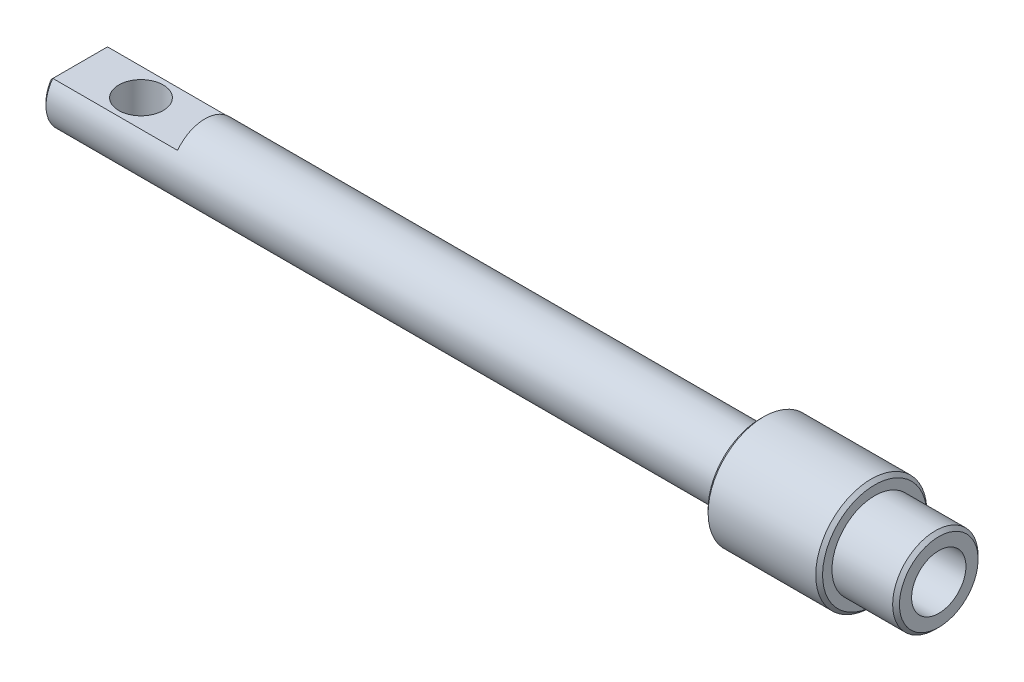
ISO-10303-21;
HEADER;
FILE_DESCRIPTION(('STEP AP214'),'2;1');
FILE_NAME('part.step','',(''),(''),'','','');
FILE_SCHEMA(('AUTOMOTIVE_DESIGN { 1 0 10303 214 1 1 1 1 }'));
ENDSEC;
DATA;
#1=APPLICATION_CONTEXT('core data for automotive mechanical design processes');
#2=APPLICATION_PROTOCOL_DEFINITION('international standard','automotive_design',2000,#1);
#3=PRODUCT_CONTEXT('',#1,'mechanical');
#4=PRODUCT('Part','Part','',(#3));
#5=PRODUCT_RELATED_PRODUCT_CATEGORY('part','',(#4));
#6=PRODUCT_DEFINITION_FORMATION('','',#4);
#7=PRODUCT_DEFINITION_CONTEXT('part definition',#1,'design');
#8=PRODUCT_DEFINITION('design','',#6,#7);
#9=PRODUCT_DEFINITION_SHAPE('','',#8);
#10=(LENGTH_UNIT() NAMED_UNIT(*) SI_UNIT(.MILLI.,.METRE.));
#11=(NAMED_UNIT(*) PLANE_ANGLE_UNIT() SI_UNIT($,.RADIAN.));
#12=(NAMED_UNIT(*) SI_UNIT($,.STERADIAN.) SOLID_ANGLE_UNIT());
#13=UNCERTAINTY_MEASURE_WITH_UNIT(LENGTH_MEASURE(1.E-05),#10,'distance_accuracy_value','');
#14=(GEOMETRIC_REPRESENTATION_CONTEXT(3) GLOBAL_UNCERTAINTY_ASSIGNED_CONTEXT((#13)) GLOBAL_UNIT_ASSIGNED_CONTEXT((#10,
#11,#12)) REPRESENTATION_CONTEXT('',''));
#15=CARTESIAN_POINT('',(0.,0.,0.));
#16=DIRECTION('',(0.,0.,1.));
#17=DIRECTION('',(1.,0.,0.));
#18=AXIS2_PLACEMENT_3D('',#15,#16,#17);
#19=CARTESIAN_POINT('',(54.5465000000149,0.,0.));
#20=DIRECTION('',(1.,0.,0.));
#21=DIRECTION('',(0.,1.,0.));
#22=AXIS2_PLACEMENT_3D('',#19,#20,#21);
#23=CONICAL_SURFACE('',#22,2.01929999997219,1.02974425867198);
#24=CARTESIAN_POINT('',(53.3331821520164,0.,0.));
#25=VERTEX_POINT('',#24);
#26=VERTEX_LOOP('',#25);
#27=FACE_BOUND('',#26,.T.);
#28=CARTESIAN_POINT('',(54.5465,0.,0.));
#29=DIRECTION('',(1.,0.,0.));
#30=DIRECTION('',(0.,0.,-1.));
#31=AXIS2_PLACEMENT_3D('',#28,#29,#30);
#32=CIRCLE('',#31,2.01929999999999);
#33=CARTESIAN_POINT('',(54.5465,0.,-2.01929999999999));
#34=VERTEX_POINT('',#33);
#35=EDGE_CURVE('E175',#34,#34,#32,.T.);
#36=ORIENTED_EDGE('',*,*,#35,.T.);
#37=EDGE_LOOP('',(#36));
#38=FACE_BOUND('',#37,.T.);
#39=ADVANCED_FACE('F17',(#27,#38),#23,.F.);
#40=CARTESIAN_POINT('',(64.0715,0.,0.));
#41=DIRECTION('',(1.,0.,0.));
#42=DIRECTION('',(0.,0.,-1.));
#43=AXIS2_PLACEMENT_3D('',#40,#41,#42);
#44=CYLINDRICAL_SURFACE('',#43,2.01929999999999);
#45=ORIENTED_EDGE('',*,*,#35,.F.);
#46=EDGE_LOOP('',(#45));
#47=FACE_BOUND('',#46,.T.);
#48=CARTESIAN_POINT('',(64.0715,0.,0.));
#49=DIRECTION('',(1.,0.,0.));
#50=DIRECTION('',(0.,0.,-1.));
#51=AXIS2_PLACEMENT_3D('',#48,#49,#50);
#52=CIRCLE('',#51,2.01929999999999);
#53=CARTESIAN_POINT('',(64.0715,0.,-2.01929999999999));
#54=VERTEX_POINT('',#53);
#55=EDGE_CURVE('E20',#54,#54,#52,.T.);
#56=ORIENTED_EDGE('',*,*,#55,.T.);
#57=EDGE_LOOP('',(#56));
#58=FACE_BOUND('',#57,.T.);
#59=ADVANCED_FACE('F152',(#47,#58),#44,.F.);
#60=CARTESIAN_POINT('',(64.0715,3.175,0.));
#61=DIRECTION('',(-1.,0.,0.));
#62=DIRECTION('',(0.,0.,1.));
#63=AXIS2_PLACEMENT_3D('',#60,#61,#62);
#64=PLANE('',#63);
#65=ORIENTED_EDGE('',*,*,#55,.F.);
#66=EDGE_LOOP('',(#65));
#67=FACE_BOUND('',#66,.T.);
#68=CARTESIAN_POINT('',(64.0715000000682,0.,0.));
#69=DIRECTION('',(-1.,0.,0.));
#70=DIRECTION('',(0.,0.,1.));
#71=AXIS2_PLACEMENT_3D('',#68,#69,#70);
#72=CIRCLE('',#71,2.92100000001483);
#73=CARTESIAN_POINT('',(64.0715000000682,0.,2.92100000001483));
#74=VERTEX_POINT('',#73);
#75=EDGE_CURVE('E189',#74,#74,#72,.T.);
#76=ORIENTED_EDGE('',*,*,#75,.F.);
#77=EDGE_LOOP('',(#76));
#78=FACE_BOUND('',#77,.T.);
#79=ADVANCED_FACE('F149',(#67,#78),#64,.F.);
#80=CARTESIAN_POINT('',(63.8175000000274,0.,0.));
#81=DIRECTION('',(-1.,0.,0.));
#82=DIRECTION('',(0.,0.,1.));
#83=AXIS2_PLACEMENT_3D('',#80,#81,#82);
#84=CONICAL_SURFACE('',#83,3.17499999999882,0.785398163285552);
#85=CARTESIAN_POINT('',(63.8175,0.,0.));
#86=DIRECTION('',(-1.,0.,0.));
#87=DIRECTION('',(0.,0.,1.));
#88=AXIS2_PLACEMENT_3D('',#85,#86,#87);
#89=CIRCLE('',#88,3.175);
#90=CARTESIAN_POINT('',(63.8175,0.,3.175));
#91=VERTEX_POINT('',#90);
#92=EDGE_CURVE('E188',#91,#91,#89,.T.);
#93=ORIENTED_EDGE('',*,*,#92,.F.);
#94=EDGE_LOOP('',(#93));
#95=FACE_BOUND('',#94,.T.);
#96=ORIENTED_EDGE('',*,*,#75,.T.);
#97=EDGE_LOOP('',(#96));
#98=FACE_BOUND('',#97,.T.);
#99=ADVANCED_FACE('F145',(#95,#98),#84,.T.);
#100=CARTESIAN_POINT('',(0.,0.,0.));
#101=DIRECTION('',(-1.,0.,0.));
#102=DIRECTION('',(0.,0.,1.));
#103=AXIS2_PLACEMENT_3D('',#100,#101,#102);
#104=CYLINDRICAL_SURFACE('',#103,3.175);
#105=CARTESIAN_POINT('',(59.309,0.,0.));
#106=DIRECTION('',(-1.,0.,0.));
#107=DIRECTION('',(0.,0.,1.));
#108=AXIS2_PLACEMENT_3D('',#105,#106,#107);
#109=CIRCLE('',#108,3.175);
#110=CARTESIAN_POINT('',(59.309,0.,3.175));
#111=VERTEX_POINT('',#110);
#112=EDGE_CURVE('E186',#111,#111,#109,.F.);
#113=ORIENTED_EDGE('',*,*,#112,.T.);
#114=EDGE_LOOP('',(#113));
#115=FACE_BOUND('',#114,.T.);
#116=ORIENTED_EDGE('',*,*,#92,.T.);
#117=EDGE_LOOP('',(#116));
#118=FACE_BOUND('',#117,.T.);
#119=ADVANCED_FACE('F141',(#115,#118),#104,.T.);
#120=CARTESIAN_POINT('',(59.309,4.1275,0.));
#121=DIRECTION('',(-1.,0.,0.));
#122=DIRECTION('',(0.,0.,1.));
#123=AXIS2_PLACEMENT_3D('',#120,#121,#122);
#124=PLANE('',#123);
#125=ORIENTED_EDGE('',*,*,#112,.F.);
#126=EDGE_LOOP('',(#125));
#127=FACE_BOUND('',#126,.T.);
#128=CARTESIAN_POINT('',(59.3090000000416,0.,0.));
#129=DIRECTION('',(-1.,0.,0.));
#130=DIRECTION('',(0.,-1.,0.));
#131=AXIS2_PLACEMENT_3D('',#128,#129,#130);
#132=CIRCLE('',#131,3.87349999999742);
#133=CARTESIAN_POINT('',(59.3090000000416,-3.87349999999742,0.));
#134=VERTEX_POINT('',#133);
#135=EDGE_CURVE('E182',#134,#134,#132,.T.);
#136=ORIENTED_EDGE('',*,*,#135,.F.);
#137=EDGE_LOOP('',(#136));
#138=FACE_BOUND('',#137,.T.);
#139=ADVANCED_FACE('F137',(#127,#138),#124,.F.);
#140=CARTESIAN_POINT('',(59.0550000000576,0.,0.));
#141=DIRECTION('',(-1.,0.,0.));
#142=DIRECTION('',(0.,-1.,0.));
#143=AXIS2_PLACEMENT_3D('',#140,#141,#142);
#144=CONICAL_SURFACE('',#143,4.12749999998141,0.785398163397448);
#145=ORIENTED_EDGE('',*,*,#135,.T.);
#146=EDGE_LOOP('',(#145));
#147=FACE_BOUND('',#146,.T.);
#148=CARTESIAN_POINT('',(59.055,0.,0.));
#149=DIRECTION('',(-1.,0.,0.));
#150=DIRECTION('',(0.,0.,1.));
#151=AXIS2_PLACEMENT_3D('',#148,#149,#150);
#152=CIRCLE('',#151,4.1275);
#153=CARTESIAN_POINT('',(59.055,0.,4.1275));
#154=VERTEX_POINT('',#153);
#155=EDGE_CURVE('E185',#154,#154,#152,.T.);
#156=ORIENTED_EDGE('',*,*,#155,.F.);
#157=EDGE_LOOP('',(#156));
#158=FACE_BOUND('',#157,.T.);
#159=ADVANCED_FACE('F133',(#147,#158),#144,.T.);
#160=CARTESIAN_POINT('',(0.,0.,0.));
#161=DIRECTION('',(-1.,0.,0.));
#162=DIRECTION('',(0.,0.,1.));
#163=AXIS2_PLACEMENT_3D('',#160,#161,#162);
#164=CYLINDRICAL_SURFACE('',#163,4.1275);
#165=ORIENTED_EDGE('',*,*,#155,.T.);
#166=EDGE_LOOP('',(#165));
#167=FACE_BOUND('',#166,.T.);
#168=CARTESIAN_POINT('',(51.0539999999651,0.,0.));
#169=DIRECTION('',(1.,0.,0.));
#170=DIRECTION('',(0.,0.,-1.));
#171=AXIS2_PLACEMENT_3D('',#168,#169,#170);
#172=CIRCLE('',#171,4.12749999998141);
#173=CARTESIAN_POINT('',(51.0539999999651,0.,-4.12749999998141));
#174=VERTEX_POINT('',#173);
#175=EDGE_CURVE('E78',#174,#174,#172,.F.);
#176=ORIENTED_EDGE('',*,*,#175,.F.);
#177=EDGE_LOOP('',(#176));
#178=FACE_BOUND('',#177,.T.);
#179=ADVANCED_FACE('F130',(#167,#178),#164,.T.);
#180=CARTESIAN_POINT('',(0.253999999999988,1.524,-4.1275));
#181=DIRECTION('',(0.70710678118656,-0.707106781186535,0.));
#182=DIRECTION('',(0.707106781186535,0.70710678118656,0.));
#183=AXIS2_PLACEMENT_3D('',#180,#181,#182);
#184=PLANE('',#183);
#185=DIRECTION('',(0.,0.,-1.));
#186=VECTOR('',#185,1.);
#187=CARTESIAN_POINT('',(0.,1.26999999999992,0.));
#188=LINE('',#187,#186);
#189=CARTESIAN_POINT('',(0.,1.27000000002306,-1.90076195256591));
#190=VERTEX_POINT('',#189);
#191=CARTESIAN_POINT('',(0.,1.27000000002306,1.90076195256591));
#192=VERTEX_POINT('',#191);
#193=EDGE_CURVE('E89',#190,#192,#188,.F.);
#194=ORIENTED_EDGE('',*,*,#193,.T.);
#195=CARTESIAN_POINT('',(0.254000000012411,1.52400000002331,2.03200000003108));
#196=CARTESIAN_POINT('',(0.242966792243199,1.51296678789272,2.0264833936355));
#197=CARTESIAN_POINT('',(0.231938593165508,1.50193850931766,2.0209468939867));
#198=CARTESIAN_POINT('',(0.210009396225619,1.48000909127371,2.00989209456968));
#199=CARTESIAN_POINT('',(0.199108289720792,1.46910784382982,2.00437422448639));
#200=CARTESIAN_POINT('',(0.177433275561178,1.44743257147695,1.9933570863424));
#201=CARTESIAN_POINT('',(0.1666592574672,1.43665843589099,1.98785825334225));
#202=CARTESIAN_POINT('',(0.145238423109592,1.41523743830884,1.97687962974457));
#203=CARTESIAN_POINT('',(0.134591494440417,1.40459046314273,1.97140027929928));
#204=CARTESIAN_POINT('',(0.113424840518852,1.38342380615828,1.96046110027078));
#205=CARTESIAN_POINT('',(0.102905000789425,1.37290400888223,1.95500171662308));
#206=CARTESIAN_POINT('',(0.0819925273347314,1.35199169453887,1.944102988748));
#207=CARTESIAN_POINT('',(0.0715997769228004,1.34159905995661,1.93866409392529));
#208=CARTESIAN_POINT('',(0.0509414828340584,1.32094102579766,1.92780689863645));
#209=CARTESIAN_POINT('',(0.0406758201468551,1.31067550687883,1.9223890517212));
#210=CARTESIAN_POINT('',(0.0202717093475782,1.29027162058558,1.91157454442521));
#211=CARTESIAN_POINT('',(0.0101331396785062,1.28013313235096,1.90617834140254));
#212=CARTESIAN_POINT('',(0.,1.27000000004619,1.90076195255046));
#213=B_SPLINE_CURVE_WITH_KNOTS('',3,(#195,#196,#197,#198,#199,#200,#201,#202,#203,#204,#205,
#206,#207,#208,#209,#210,#211,#212),.UNSPECIFIED.,.F.,.F.,(4,2,2,2,2,2,2,2,4),(0.,
0.0496494369638143,0.0987723283658608,0.14736844039259,0.195437562876371,0.242979510145413,
0.289994121897476,0.336481264100059,0.382440829920001),.UNSPECIFIED.);
#214=CARTESIAN_POINT('',(0.254000000006199,1.52400000001165,2.03200000001554));
#215=VERTEX_POINT('',#214);
#216=EDGE_CURVE('E74',#215,#192,#213,.T.);
#217=ORIENTED_EDGE('',*,*,#216,.F.);
#218=DIRECTION('',(0.,0.,-1.));
#219=VECTOR('',#218,1.);
#220=CARTESIAN_POINT('',(0.253999999999988,1.524,-4.1275));
#221=LINE('',#220,#219);
#222=CARTESIAN_POINT('',(0.2540000000062,1.52400000001165,-2.03200000001554));
#223=VERTEX_POINT('',#222);
#224=EDGE_CURVE('E69',#215,#223,#221,.T.);
#225=ORIENTED_EDGE('',*,*,#224,.T.);
#226=CARTESIAN_POINT('',(0.,1.27000000004619,-1.90076195255046));
#227=CARTESIAN_POINT('',(0.0101331396785264,1.28013313235041,-1.90617834140293));
#228=CARTESIAN_POINT('',(0.0202717093475982,1.29027162058453,-1.91157454442594));
#229=CARTESIAN_POINT('',(0.0406758201468748,1.31067550687692,-1.92238905172252));
#230=CARTESIAN_POINT('',(0.0509414828340779,1.32094102579539,-1.92780689863803));
#231=CARTESIAN_POINT('',(0.0715997769228198,1.34159905995374,-1.93866409392729));
#232=CARTESIAN_POINT('',(0.0819925273347507,1.35199169453578,-1.94410298875017));
#233=CARTESIAN_POINT('',(0.102905000789445,1.37290400887883,-1.95500171662549));
#234=CARTESIAN_POINT('',(0.113424840518872,1.3834238061548,-1.96046110027326));
#235=CARTESIAN_POINT('',(0.134591494440436,1.40459046313923,-1.97140027930179));
#236=CARTESIAN_POINT('',(0.145238423109612,1.4152374383054,-1.97687962974705));
#237=CARTESIAN_POINT('',(0.16665925746722,1.43665843588784,-1.98785825334456));
#238=CARTESIAN_POINT('',(0.177433275561198,1.447432571474,-1.99335708634456));
#239=CARTESIAN_POINT('',(0.199108289720812,1.46910784382746,-2.00437422448815));
#240=CARTESIAN_POINT('',(0.210009396225639,1.48000909127171,-2.00989209457118));
#241=CARTESIAN_POINT('',(0.231938593165529,1.50193850931655,-2.02094689398754));
#242=CARTESIAN_POINT('',(0.24296679224322,1.51296678789214,-2.02648339363596));
#243=CARTESIAN_POINT('',(0.254000000012411,1.52400000002331,-2.03200000003108));
#244=B_SPLINE_CURVE_WITH_KNOTS('',3,(#226,#227,#228,#229,#230,#231,#232,#233,#234,#235,#236,
#237,#238,#239,#240,#241,#242,#243),.UNSPECIFIED.,.F.,.F.,(4,2,2,2,2,2,2,2,4),(0.,
0.0459595658193077,0.0924467080214363,0.139461319773225,0.187003267042175,0.235072389526048,
0.283668501553057,0.332791392955573,0.382440829920046),.UNSPECIFIED.);
#245=EDGE_CURVE('E72',#190,#223,#244,.T.);
#246=ORIENTED_EDGE('',*,*,#245,.F.);
#247=EDGE_LOOP('',(#194,#217,#225,#246));
#248=FACE_BOUND('',#247,.T.);
#249=ADVANCED_FACE('F71',(#248),#184,.F.);
#250=CARTESIAN_POINT('',(51.0539999999651,0.,0.));
#251=DIRECTION('',(1.,0.,0.));
#252=DIRECTION('',(0.,1.,0.));
#253=AXIS2_PLACEMENT_3D('',#250,#251,#252);
#254=CONICAL_SURFACE('',#253,4.12749999998141,0.785398163397448);
#255=CARTESIAN_POINT('',(50.7999999999811,0.,0.));
#256=DIRECTION('',(1.,0.,0.));
#257=DIRECTION('',(0.,1.,0.));
#258=AXIS2_PLACEMENT_3D('',#255,#256,#257);
#259=CIRCLE('',#258,3.87349999999742);
#260=CARTESIAN_POINT('',(50.7999999999811,3.87349999999742,0.));
#261=VERTEX_POINT('',#260);
#262=EDGE_CURVE('E75',#261,#261,#259,.T.);
#263=ORIENTED_EDGE('',*,*,#262,.T.);
#264=EDGE_LOOP('',(#263));
#265=FACE_BOUND('',#264,.T.);
#266=ORIENTED_EDGE('',*,*,#175,.T.);
#267=EDGE_LOOP('',(#266));
#268=FACE_BOUND('',#267,.T.);
#269=ADVANCED_FACE('F123',(#265,#268),#254,.T.);
#270=CARTESIAN_POINT('',(9.525,2.54,-4.1275));
#271=DIRECTION('',(1.,0.,0.));
#272=DIRECTION('',(0.,0.,-1.));
#273=AXIS2_PLACEMENT_3D('',#270,#271,#272);
#274=PLANE('',#273);
#275=CARTESIAN_POINT('',(9.525,0.,0.));
#276=DIRECTION('',(-1.,0.,0.));
#277=DIRECTION('',(0.,0.,1.));
#278=AXIS2_PLACEMENT_3D('',#275,#276,#277);
#279=CIRCLE('',#278,2.54);
#280=CARTESIAN_POINT('',(9.525,1.524,-2.032));
#281=VERTEX_POINT('',#280);
#282=CARTESIAN_POINT('',(9.525,1.524,2.032));
#283=VERTEX_POINT('',#282);
#284=EDGE_CURVE('E82',#281,#283,#279,.F.);
#285=ORIENTED_EDGE('',*,*,#284,.F.);
#286=DIRECTION('',(0.,0.,-1.));
#287=VECTOR('',#286,1.);
#288=CARTESIAN_POINT('',(9.525,1.524,-4.1275));
#289=LINE('',#288,#287);
#290=EDGE_CURVE('E55',#281,#283,#289,.F.);
#291=ORIENTED_EDGE('',*,*,#290,.T.);
#292=EDGE_LOOP('',(#285,#291));
#293=FACE_BOUND('',#292,.T.);
#294=ADVANCED_FACE('F119',(#293),#274,.F.);
#295=CARTESIAN_POINT('',(0.,0.,0.));
#296=DIRECTION('',(1.,0.,0.));
#297=DIRECTION('',(0.,0.,-1.));
#298=AXIS2_PLACEMENT_3D('',#295,#296,#297);
#299=PLANE('',#298);
#300=CARTESIAN_POINT('',(0.,0.,0.));
#301=DIRECTION('',(1.,0.,0.));
#302=DIRECTION('',(0.,0.,-1.));
#303=AXIS2_PLACEMENT_3D('',#300,#301,#302);
#304=CIRCLE('',#303,2.28600000008328);
#305=EDGE_CURVE('E46',#192,#190,#304,.T.);
#306=ORIENTED_EDGE('',*,*,#305,.F.);
#307=ORIENTED_EDGE('',*,*,#193,.F.);
#308=EDGE_LOOP('',(#306,#307));
#309=FACE_BOUND('',#308,.T.);
#310=ADVANCED_FACE('F116',(#309),#299,.F.);
#311=CARTESIAN_POINT('',(0.,1.524,-4.1275));
#312=DIRECTION('',(0.,-1.,0.));
#313=DIRECTION('',(0.,0.,-1.));
#314=AXIS2_PLACEMENT_3D('',#311,#312,#313);
#315=PLANE('',#314);
#316=ORIENTED_EDGE('',*,*,#224,.F.);
#317=DIRECTION('',(-1.,0.,0.));
#318=VECTOR('',#317,1.);
#319=CARTESIAN_POINT('',(0.,1.524,2.032));
#320=LINE('',#319,#318);
#321=EDGE_CURVE('E64',#283,#215,#320,.T.);
#322=ORIENTED_EDGE('',*,*,#321,.F.);
#323=ORIENTED_EDGE('',*,*,#290,.F.);
#324=DIRECTION('',(-1.,0.,0.));
#325=VECTOR('',#324,1.);
#326=CARTESIAN_POINT('',(0.,1.524,-2.032));
#327=LINE('',#326,#325);
#328=EDGE_CURVE('E63',#223,#281,#327,.F.);
#329=ORIENTED_EDGE('',*,*,#328,.F.);
#330=EDGE_LOOP('',(#316,#322,#323,#329));
#331=FACE_BOUND('',#330,.T.);
#332=CARTESIAN_POINT('',(4.7752,1.524,0.));
#333=DIRECTION('',(0.,1.,0.));
#334=DIRECTION('',(0.,0.,1.));
#335=AXIS2_PLACEMENT_3D('',#332,#333,#334);
#336=CIRCLE('',#335,1.651);
#337=CARTESIAN_POINT('',(4.7752,1.524,1.651));
#338=VERTEX_POINT('',#337);
#339=EDGE_CURVE('E178',#338,#338,#336,.F.);
#340=ORIENTED_EDGE('',*,*,#339,.T.);
#341=EDGE_LOOP('',(#340));
#342=FACE_BOUND('',#341,.T.);
#343=ADVANCED_FACE('F80',(#331,#342),#315,.F.);
#344=CARTESIAN_POINT('',(50.8,2.54,0.));
#345=DIRECTION('',(1.,0.,0.));
#346=DIRECTION('',(0.,0.,-1.));
#347=AXIS2_PLACEMENT_3D('',#344,#345,#346);
#348=PLANE('',#347);
#349=CARTESIAN_POINT('',(50.8,0.,0.));
#350=DIRECTION('',(-1.,0.,0.));
#351=DIRECTION('',(0.,0.,1.));
#352=AXIS2_PLACEMENT_3D('',#349,#350,#351);
#353=CIRCLE('',#352,2.54);
#354=CARTESIAN_POINT('',(50.8,0.,2.54));
#355=VERTEX_POINT('',#354);
#356=EDGE_CURVE('E65',#355,#355,#353,.T.);
#357=ORIENTED_EDGE('',*,*,#356,.F.);
#358=EDGE_LOOP('',(#357));
#359=FACE_BOUND('',#358,.T.);
#360=ORIENTED_EDGE('',*,*,#262,.F.);
#361=EDGE_LOOP('',(#360));
#362=FACE_BOUND('',#361,.T.);
#363=ADVANCED_FACE('F107',(#359,#362),#348,.F.);
#364=CARTESIAN_POINT('',(0.253999999927146,0.,0.));
#365=DIRECTION('',(1.,0.,0.));
#366=DIRECTION('',(0.,0.,-1.));
#367=AXIS2_PLACEMENT_3D('',#364,#365,#366);
#368=CONICAL_SURFACE('',#367,2.53999999995358,0.785398163285552);
#369=ORIENTED_EDGE('',*,*,#305,.T.);
#370=ORIENTED_EDGE('',*,*,#245,.T.);
#371=CARTESIAN_POINT('',(0.253999999999988,0.,0.));
#372=DIRECTION('',(-1.,0.,0.));
#373=DIRECTION('',(0.,0.,1.));
#374=AXIS2_PLACEMENT_3D('',#371,#372,#373);
#375=CIRCLE('',#374,2.54);
#376=EDGE_CURVE('E26',#215,#223,#375,.F.);
#377=ORIENTED_EDGE('',*,*,#376,.F.);
#378=ORIENTED_EDGE('',*,*,#216,.T.);
#379=EDGE_LOOP('',(#369,#370,#377,#378));
#380=FACE_BOUND('',#379,.T.);
#381=ADVANCED_FACE('F77',(#380),#368,.T.);
#382=CARTESIAN_POINT('',(4.7752,-4.1275,0.));
#383=DIRECTION('',(0.,1.,0.));
#384=DIRECTION('',(0.,0.,1.));
#385=AXIS2_PLACEMENT_3D('',#382,#383,#384);
#386=CYLINDRICAL_SURFACE('',#385,1.651);
#387=ORIENTED_EDGE('',*,*,#339,.F.);
#388=EDGE_LOOP('',(#387));
#389=FACE_BOUND('',#388,.T.);
#390=CARTESIAN_POINT('',(4.7752,-1.93023288750347,1.651));
#391=CARTESIAN_POINT('',(4.85646201943131,-1.93022832796075,1.65100295487648));
#392=CARTESIAN_POINT('',(4.9377101703691,-1.93545031064879,1.64495688276442));
#393=CARTESIAN_POINT('',(5.09736266166419,-1.95532129239297,1.62127891621094));
#394=CARTESIAN_POINT('',(5.17576238193255,-1.96998494240175,1.60362901481938));
#395=CARTESIAN_POINT('',(5.32693738429687,-2.00620303869106,1.55806822288757));
#396=CARTESIAN_POINT('',(5.39975629567047,-2.02769536396475,1.53024950816958));
#397=CARTESIAN_POINT('',(5.53959423847157,-2.07503294576299,1.46541743193979));
#398=CARTESIAN_POINT('',(5.60661207302241,-2.10087909734255,1.42840217906874));
#399=CARTESIAN_POINT('',(5.74372321520538,-2.15856796235187,1.33991167133507));
#400=CARTESIAN_POINT('',(5.81282562798346,-2.19073415994438,1.28711178239919));
#401=CARTESIAN_POINT('',(5.94204483047697,-2.25481260344708,1.17124417361659));
#402=CARTESIAN_POINT('',(6.00215316002489,-2.28672458385401,1.10816690151639));
#403=CARTESIAN_POINT('',(6.11970917996953,-2.35176398743983,0.963287139047611));
#404=CARTESIAN_POINT('',(6.17571161209016,-2.38447758116628,0.880107187867553));
#405=CARTESIAN_POINT('',(6.27245746569701,-2.44255687332933,0.702971597013864));
#406=CARTESIAN_POINT('',(6.31321723177168,-2.46793043577051,0.609027641577713));
#407=CARTESIAN_POINT('',(6.37354523182976,-2.50599734977296,0.423715505363594));
#408=CARTESIAN_POINT('',(6.39492605370011,-2.5197638141767,0.333163937352283));
#409=CARTESIAN_POINT('',(6.42210481899346,-2.5373176836664,0.148838971922276));
#410=CARTESIAN_POINT('',(6.42792100547082,-2.54111677124906,0.0550694769215767));
#411=CARTESIAN_POINT('',(6.42389992273056,-2.53850660157225,-0.11832188322266));
#412=CARTESIAN_POINT('',(6.41620728108137,-2.53349582794341,-0.198026297949138));
#413=CARTESIAN_POINT('',(6.3895971982853,-2.5163412312454,-0.354735563601963));
#414=CARTESIAN_POINT('',(6.37067892002473,-2.50419687621433,-0.43174021274887));
#415=CARTESIAN_POINT('',(6.32256495144954,-2.47382116276705,-0.581046235874166));
#416=CARTESIAN_POINT('',(6.29338137596747,-2.45559698090336,-0.653353035474254));
#417=CARTESIAN_POINT('',(6.22585169272839,-2.41443030753334,-0.792065316761022));
#418=CARTESIAN_POINT('',(6.1875036478653,-2.39148681864383,-0.858469546737071));
#419=CARTESIAN_POINT('',(6.09722204899199,-2.33923320779783,-0.992682390637348));
#420=CARTESIAN_POINT('',(6.04417451811917,-2.30948364193373,-1.0595688557384));
#421=CARTESIAN_POINT('',(5.92888816459171,-2.24820112910611,-1.18406871697569));
#422=CARTESIAN_POINT('',(5.86663634379531,-2.21666569968074,-1.24166875450907));
#423=CARTESIAN_POINT('',(5.72415599751361,-2.1498340327909,-1.3545122565537));
#424=CARTESIAN_POINT('',(5.64262970220515,-2.11465602310324,-1.4082011633299));
#425=CARTESIAN_POINT('',(5.46965979445157,-2.04980009164811,-1.50104362732188));
#426=CARTESIAN_POINT('',(5.37822693833383,-2.02011629740252,-1.54021274941956));
#427=CARTESIAN_POINT('',(5.20223869092727,-1.97538215342132,-1.59705123617727));
#428=CARTESIAN_POINT('',(5.11888338962978,-1.95875974543844,-1.61714148191012));
#429=CARTESIAN_POINT('',(4.94874081293891,-1.93620066329332,-1.64409805256792));
#430=CARTESIAN_POINT('',(4.86196250171816,-1.93023775567356,-1.65099684511318));
#431=CARTESIAN_POINT('',(4.69393798056841,-1.93022832796076,-1.65100295487647));
#432=CARTESIAN_POINT('',(4.61268982963061,-1.93545031064882,-1.6449568827644));
#433=CARTESIAN_POINT('',(4.45303733833551,-1.95532129239302,-1.62127891621088));
#434=CARTESIAN_POINT('',(4.37463761806715,-1.96998494240181,-1.6036290148193));
#435=CARTESIAN_POINT('',(4.22346261570283,-2.00620303869114,-1.55806822288747));
#436=CARTESIAN_POINT('',(4.15064370432923,-2.02769536396485,-1.53024950816946));
#437=CARTESIAN_POINT('',(4.01080576152813,-2.0750329457631,-1.46541743193963));
#438=CARTESIAN_POINT('',(3.94378792697729,-2.10087909734267,-1.42840217906857));
#439=CARTESIAN_POINT('',(3.80667678479432,-2.158567962352,-1.33991167133485));
#440=CARTESIAN_POINT('',(3.73757437201624,-2.19073415994452,-1.28711178239896));
#441=CARTESIAN_POINT('',(3.60835516952274,-2.25481260344722,-1.17124417361631));
#442=CARTESIAN_POINT('',(3.54824683997483,-2.28672458385416,-1.10816690151608));
#443=CARTESIAN_POINT('',(3.43069082003021,-2.35176398743997,-0.963287139047255));
#444=CARTESIAN_POINT('',(3.37468838790961,-2.38447758116642,-0.88010718786718));
#445=CARTESIAN_POINT('',(3.2779425343028,-2.44255687332944,-0.702971597013459));
#446=CARTESIAN_POINT('',(3.23718276822815,-2.46793043577061,-0.609027641577295));
#447=CARTESIAN_POINT('',(3.17685476817013,-2.50599734977303,-0.423715505363166));
#448=CARTESIAN_POINT('',(3.1554739462998,-2.51976381417675,-0.333163937351861));
#449=CARTESIAN_POINT('',(3.12829518100651,-2.53731768366642,-0.14883897192187));
#450=CARTESIAN_POINT('',(3.12247899452917,-2.54111677124907,-0.0550694769211815));
#451=CARTESIAN_POINT('',(3.12650007726947,-2.53850660157223,0.118321883223035));
#452=CARTESIAN_POINT('',(3.13419271891868,-2.53349582794338,0.198026297949505));
#453=CARTESIAN_POINT('',(3.16080280171478,-2.51634123124535,0.354735563602312));
#454=CARTESIAN_POINT('',(3.17972107997536,-2.50419687621427,0.431740212749208));
#455=CARTESIAN_POINT('',(3.22783504855058,-2.47382116276697,0.581046235874491));
#456=CARTESIAN_POINT('',(3.25701862403267,-2.45559698090327,0.653353035474575));
#457=CARTESIAN_POINT('',(3.32454830727178,-2.41443030753324,0.792065316761333));
#458=CARTESIAN_POINT('',(3.36289635213489,-2.39148681864372,0.858469546737376));
#459=CARTESIAN_POINT('',(3.45317795100823,-2.3392332077977,0.99268239063764));
#460=CARTESIAN_POINT('',(3.50622548188107,-2.30948364193359,1.05956885573868));
#461=CARTESIAN_POINT('',(3.62151183540857,-2.24820112910596,1.18406871697596));
#462=CARTESIAN_POINT('',(3.68376365620499,-2.21666569968059,1.24166875450934));
#463=CARTESIAN_POINT('',(3.82624400248673,-2.14983403279075,1.35451225655394));
#464=CARTESIAN_POINT('',(3.90777029779522,-2.11465602310309,1.40820116333013));
#465=CARTESIAN_POINT('',(4.08074020554883,-2.04980009164797,1.50104362732207));
#466=CARTESIAN_POINT('',(4.1721730616666,-2.02011629740239,1.54021274941973));
#467=CARTESIAN_POINT('',(4.34816130907307,-1.97538215342125,1.59705123617735));
#468=CARTESIAN_POINT('',(4.43151661037045,-1.95875974543841,1.61714148191016));
#469=CARTESIAN_POINT('',(4.60165918706107,-1.93620066329333,1.64409805256791));
#470=CARTESIAN_POINT('',(4.68843749828169,-1.93023775567357,1.65099684511316));
#471=CARTESIAN_POINT('',(4.7752,-1.93023288750347,1.651));
#472=B_SPLINE_CURVE_WITH_KNOTS('',3,(#390,#391,#392,#393,#394,#395,#396,#397,#398,#399,#400,
#401,#402,#403,#404,#405,#406,#407,#408,#409,#410,#411,#412,#413,#414,#415,#416,#417,#418,#419,
#420,#421,#422,#423,#424,#425,#426,#427,#428,#429,#430,#431,#432,#433,#434,#435,#436,#437,#438,
#439,#440,#441,#442,#443,#444,#445,#446,#447,#448,#449,#450,#451,#452,#453,#454,#455,#456,#457,
#458,#459,#460,#461,#462,#463,#464,#465,#466,#467,#468,#469,#470,#471),.UNSPECIFIED.,.T.,.F.,(4,
2,2,2,2,2,2,2,2,2,2,2,2,2,2,2,2,2,2,2,2,2,2,2,2,2,2,2,2,2,2,2,2,2,2,2,2,2,2,2,4),(0.,
0.243404380841016,0.487187373671151,0.72881326320468,0.970488886691588,1.2476151668662,
1.52500050535174,1.83969457846726,2.15405023343472,2.43447262100292,2.7145661858294,
2.95410309677428,3.19365787261547,3.43293087558715,3.67225449881372,3.94242470875155,
4.2129801584134,4.52279188767839,4.83227053871038,5.09279257382008,5.35267256645113,
5.59607694729217,5.83985994012233,6.08148582965589,6.32316145314282,6.60028773331748,
6.87767307180305,7.19236714491857,7.50672279988604,7.78714518745419,8.06723875228064,
8.3067756632255,8.54633043906668,8.78560344203837,9.02492706526496,9.29509727520281,
9.56565272486469,9.8754644541297,10.1849431051617,10.445465140271,10.7053451329017),.UNSPECIFIED.);
#473=CARTESIAN_POINT('',(4.7752,-1.93023288750347,1.651));
#474=VERTEX_POINT('',#473);
#475=EDGE_CURVE('E11',#474,#474,#472,.T.);
#476=ORIENTED_EDGE('',*,*,#475,.F.);
#477=EDGE_LOOP('',(#476));
#478=FACE_BOUND('',#477,.T.);
#479=ADVANCED_FACE('F106',(#389,#478),#386,.F.);
#480=CARTESIAN_POINT('',(0.,0.,0.));
#481=DIRECTION('',(-1.,0.,0.));
#482=DIRECTION('',(0.,0.,1.));
#483=AXIS2_PLACEMENT_3D('',#480,#481,#482);
#484=CYLINDRICAL_SURFACE('',#483,2.54);
#485=ORIENTED_EDGE('',*,*,#356,.T.);
#486=EDGE_LOOP('',(#485));
#487=FACE_BOUND('',#486,.T.);
#488=ORIENTED_EDGE('',*,*,#475,.T.);
#489=EDGE_LOOP('',(#488));
#490=FACE_BOUND('',#489,.T.);
#491=ORIENTED_EDGE('',*,*,#376,.T.);
#492=ORIENTED_EDGE('',*,*,#328,.T.);
#493=ORIENTED_EDGE('',*,*,#284,.T.);
#494=ORIENTED_EDGE('',*,*,#321,.T.);
#495=EDGE_LOOP('',(#491,#492,#493,#494));
#496=FACE_BOUND('',#495,.T.);
#497=ADVANCED_FACE('F61',(#487,#490,#496),#484,.T.);
#498=CLOSED_SHELL('',(#39,#59,#79,#99,#119,#139,#159,#179,#249,#269,#294,#310,#343,#363,#381,
#479,#497));
#499=MANIFOLD_SOLID_BREP('B1',#498);
#500=ADVANCED_BREP_SHAPE_REPRESENTATION('',(#18,#499),#14);
#501=SHAPE_DEFINITION_REPRESENTATION(#9,#500);
ENDSEC;
END-ISO-10303-21;
